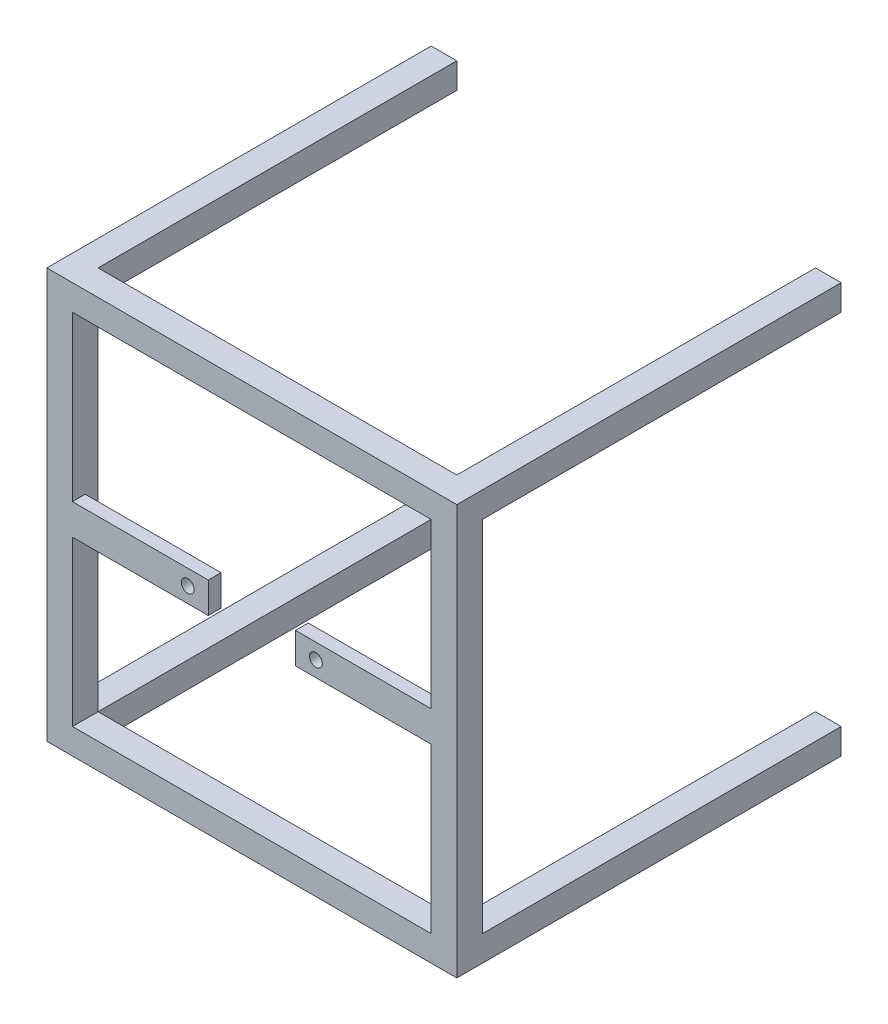
ISO-10303-21;
HEADER;
FILE_DESCRIPTION(('STEP AP214'),'2;1');
FILE_NAME('part.step','',(''),(''),'','','');
FILE_SCHEMA(('AUTOMOTIVE_DESIGN { 1 0 10303 214 1 1 1 1 }'));
ENDSEC;
DATA;
#1=APPLICATION_CONTEXT('core data for automotive mechanical design processes');
#2=APPLICATION_PROTOCOL_DEFINITION('international standard','automotive_design',2000,#1);
#3=PRODUCT_CONTEXT('',#1,'mechanical');
#4=PRODUCT('Part','Part','',(#3));
#5=PRODUCT_RELATED_PRODUCT_CATEGORY('part','',(#4));
#6=PRODUCT_DEFINITION_FORMATION('','',#4);
#7=PRODUCT_DEFINITION_CONTEXT('part definition',#1,'design');
#8=PRODUCT_DEFINITION('design','',#6,#7);
#9=PRODUCT_DEFINITION_SHAPE('','',#8);
#10=(LENGTH_UNIT() NAMED_UNIT(*) SI_UNIT(.MILLI.,.METRE.));
#11=(NAMED_UNIT(*) PLANE_ANGLE_UNIT() SI_UNIT($,.RADIAN.));
#12=(NAMED_UNIT(*) SI_UNIT($,.STERADIAN.) SOLID_ANGLE_UNIT());
#13=UNCERTAINTY_MEASURE_WITH_UNIT(LENGTH_MEASURE(1.E-05),#10,'distance_accuracy_value','');
#14=(GEOMETRIC_REPRESENTATION_CONTEXT(3) GLOBAL_UNCERTAINTY_ASSIGNED_CONTEXT((#13)) GLOBAL_UNIT_ASSIGNED_CONTEXT((#10,
#11,#12)) REPRESENTATION_CONTEXT('',''));
#15=CARTESIAN_POINT('',(0.,0.,0.));
#16=DIRECTION('',(0.,0.,1.));
#17=DIRECTION('',(1.,0.,0.));
#18=AXIS2_PLACEMENT_3D('',#15,#16,#17);
#19=CARTESIAN_POINT('',(0.,0.,10.));
#20=DIRECTION('',(1.,0.,0.));
#21=DIRECTION('',(0.,1.,0.));
#22=AXIS2_PLACEMENT_3D('',#19,#20,#21);
#23=PLANE('',#22);
#24=DIRECTION('',(0.,0.,-1.));
#25=VECTOR('',#24,1.);
#26=CARTESIAN_POINT('',(0.,0.,10.));
#27=LINE('',#26,#25);
#28=CARTESIAN_POINT('',(0.,0.,160.));
#29=VERTEX_POINT('',#28);
#30=CARTESIAN_POINT('',(0.,0.,10.));
#31=VERTEX_POINT('',#30);
#32=EDGE_CURVE('E248',#29,#31,#27,.T.);
#33=ORIENTED_EDGE('',*,*,#32,.T.);
#34=DIRECTION('',(0.,1.,0.));
#35=VECTOR('',#34,1.);
#36=CARTESIAN_POINT('',(0.,0.,10.));
#37=LINE('',#36,#35);
#38=CARTESIAN_POINT('',(0.,-10.,10.));
#39=VERTEX_POINT('',#38);
#40=EDGE_CURVE('E511',#39,#31,#37,.T.);
#41=ORIENTED_EDGE('',*,*,#40,.F.);
#42=DIRECTION('',(0.,0.,1.));
#43=VECTOR('',#42,1.);
#44=CARTESIAN_POINT('',(0.,-10.,0.));
#45=LINE('',#44,#43);
#46=CARTESIAN_POINT('',(0.,-10.,150.));
#47=VERTEX_POINT('',#46);
#48=EDGE_CURVE('E490',#39,#47,#45,.T.);
#49=ORIENTED_EDGE('',*,*,#48,.T.);
#50=DIRECTION('',(0.,-1.,0.));
#51=VECTOR('',#50,1.);
#52=CARTESIAN_POINT('',(0.,0.,150.));
#53=LINE('',#52,#51);
#54=CARTESIAN_POINT('',(0.,-150.,150.));
#55=VERTEX_POINT('',#54);
#56=EDGE_CURVE('E383',#47,#55,#53,.T.);
#57=ORIENTED_EDGE('',*,*,#56,.T.);
#58=DIRECTION('',(0.,0.,1.));
#59=VECTOR('',#58,1.);
#60=CARTESIAN_POINT('',(0.,-150.,0.));
#61=LINE('',#60,#59);
#62=CARTESIAN_POINT('',(0.,-150.,10.));
#63=VERTEX_POINT('',#62);
#64=EDGE_CURVE('E424',#63,#55,#61,.T.);
#65=ORIENTED_EDGE('',*,*,#64,.F.);
#66=CARTESIAN_POINT('',(0.,-160.,10.));
#67=VERTEX_POINT('',#66);
#68=EDGE_CURVE('E927',#67,#63,#37,.T.);
#69=ORIENTED_EDGE('',*,*,#68,.F.);
#70=DIRECTION('',(0.,0.,-1.));
#71=VECTOR('',#70,1.);
#72=CARTESIAN_POINT('',(0.,-160.,10.));
#73=LINE('',#72,#71);
#74=CARTESIAN_POINT('',(0.,-160.,160.));
#75=VERTEX_POINT('',#74);
#76=EDGE_CURVE('E240',#75,#67,#73,.T.);
#77=ORIENTED_EDGE('',*,*,#76,.F.);
#78=DIRECTION('',(0.,-1.,0.));
#79=VECTOR('',#78,1.);
#80=CARTESIAN_POINT('',(0.,0.,160.));
#81=LINE('',#80,#79);
#82=EDGE_CURVE('E384',#29,#75,#81,.T.);
#83=ORIENTED_EDGE('',*,*,#82,.F.);
#84=EDGE_LOOP('',(#33,#41,#49,#57,#65,#69,#77,#83));
#85=FACE_BOUND('',#84,.T.);
#86=ADVANCED_FACE('F39',(#85),#23,.F.);
#87=CARTESIAN_POINT('',(0.,-160.,10.));
#88=DIRECTION('',(0.,1.,0.));
#89=DIRECTION('',(0.,0.,1.));
#90=AXIS2_PLACEMENT_3D('',#87,#88,#89);
#91=PLANE('',#90);
#92=ORIENTED_EDGE('',*,*,#76,.T.);
#93=DIRECTION('',(-1.,0.,0.));
#94=VECTOR('',#93,1.);
#95=CARTESIAN_POINT('',(160.,-160.,10.));
#96=LINE('',#95,#94);
#97=CARTESIAN_POINT('',(10.,-160.,10.));
#98=VERTEX_POINT('',#97);
#99=EDGE_CURVE('E221',#98,#67,#96,.T.);
#100=ORIENTED_EDGE('',*,*,#99,.F.);
#101=DIRECTION('',(0.,0.,1.));
#102=VECTOR('',#101,1.);
#103=CARTESIAN_POINT('',(10.,-160.,0.));
#104=LINE('',#103,#102);
#105=CARTESIAN_POINT('',(10.,-160.,150.));
#106=VERTEX_POINT('',#105);
#107=EDGE_CURVE('E419',#98,#106,#104,.T.);
#108=ORIENTED_EDGE('',*,*,#107,.T.);
#109=DIRECTION('',(1.,0.,0.));
#110=VECTOR('',#109,1.);
#111=CARTESIAN_POINT('',(0.,-160.,150.));
#112=LINE('',#111,#110);
#113=CARTESIAN_POINT('',(150.,-160.,150.));
#114=VERTEX_POINT('',#113);
#115=EDGE_CURVE('E401',#106,#114,#112,.T.);
#116=ORIENTED_EDGE('',*,*,#115,.T.);
#117=DIRECTION('',(0.,0.,1.));
#118=VECTOR('',#117,1.);
#119=CARTESIAN_POINT('',(150.,-160.,0.));
#120=LINE('',#119,#118);
#121=CARTESIAN_POINT('',(150.,-160.,10.));
#122=VERTEX_POINT('',#121);
#123=EDGE_CURVE('E231',#122,#114,#120,.T.);
#124=ORIENTED_EDGE('',*,*,#123,.F.);
#125=CARTESIAN_POINT('',(160.,-160.,10.));
#126=VERTEX_POINT('',#125);
#127=EDGE_CURVE('E213',#126,#122,#96,.T.);
#128=ORIENTED_EDGE('',*,*,#127,.F.);
#129=DIRECTION('',(0.,0.,-1.));
#130=VECTOR('',#129,1.);
#131=CARTESIAN_POINT('',(160.,-160.,10.));
#132=LINE('',#131,#130);
#133=CARTESIAN_POINT('',(160.,-160.,160.));
#134=VERTEX_POINT('',#133);
#135=EDGE_CURVE('E228',#134,#126,#132,.T.);
#136=ORIENTED_EDGE('',*,*,#135,.F.);
#137=DIRECTION('',(1.,0.,0.));
#138=VECTOR('',#137,1.);
#139=CARTESIAN_POINT('',(0.,-160.,160.));
#140=LINE('',#139,#138);
#141=EDGE_CURVE('E387',#75,#134,#140,.T.);
#142=ORIENTED_EDGE('',*,*,#141,.F.);
#143=EDGE_LOOP('',(#92,#100,#108,#116,#124,#128,#136,#142));
#144=FACE_BOUND('',#143,.T.);
#145=ADVANCED_FACE('F226',(#144),#91,.F.);
#146=CARTESIAN_POINT('',(160.,0.,10.));
#147=DIRECTION('',(-1.,0.,0.));
#148=DIRECTION('',(0.,-1.,0.));
#149=AXIS2_PLACEMENT_3D('',#146,#147,#148);
#150=PLANE('',#149);
#151=ORIENTED_EDGE('',*,*,#135,.T.);
#152=DIRECTION('',(0.,1.,0.));
#153=VECTOR('',#152,1.);
#154=CARTESIAN_POINT('',(160.,0.,10.));
#155=LINE('',#154,#153);
#156=CARTESIAN_POINT('',(160.,-150.,10.));
#157=VERTEX_POINT('',#156);
#158=EDGE_CURVE('E209',#126,#157,#155,.T.);
#159=ORIENTED_EDGE('',*,*,#158,.T.);
#160=DIRECTION('',(0.,0.,1.));
#161=VECTOR('',#160,1.);
#162=CARTESIAN_POINT('',(160.,-150.,0.));
#163=LINE('',#162,#161);
#164=CARTESIAN_POINT('',(160.,-150.,150.));
#165=VERTEX_POINT('',#164);
#166=EDGE_CURVE('E446',#157,#165,#163,.T.);
#167=ORIENTED_EDGE('',*,*,#166,.T.);
#168=DIRECTION('',(0.,1.,0.));
#169=VECTOR('',#168,1.);
#170=CARTESIAN_POINT('',(160.,0.,150.));
#171=LINE('',#170,#169);
#172=CARTESIAN_POINT('',(160.,-10.,150.));
#173=VERTEX_POINT('',#172);
#174=EDGE_CURVE('E404',#165,#173,#171,.T.);
#175=ORIENTED_EDGE('',*,*,#174,.T.);
#176=DIRECTION('',(0.,0.,1.));
#177=VECTOR('',#176,1.);
#178=CARTESIAN_POINT('',(160.,-10.,0.));
#179=LINE('',#178,#177);
#180=CARTESIAN_POINT('',(160.,-10.,10.));
#181=VERTEX_POINT('',#180);
#182=EDGE_CURVE('E465',#181,#173,#179,.T.);
#183=ORIENTED_EDGE('',*,*,#182,.F.);
#184=CARTESIAN_POINT('',(160.,0.,10.));
#185=VERTEX_POINT('',#184);
#186=EDGE_CURVE('E222',#181,#185,#155,.T.);
#187=ORIENTED_EDGE('',*,*,#186,.T.);
#188=DIRECTION('',(0.,0.,-1.));
#189=VECTOR('',#188,1.);
#190=CARTESIAN_POINT('',(160.,0.,10.));
#191=LINE('',#190,#189);
#192=CARTESIAN_POINT('',(160.,0.,160.));
#193=VERTEX_POINT('',#192);
#194=EDGE_CURVE('E241',#193,#185,#191,.T.);
#195=ORIENTED_EDGE('',*,*,#194,.F.);
#196=DIRECTION('',(0.,1.,0.));
#197=VECTOR('',#196,1.);
#198=CARTESIAN_POINT('',(160.,0.,160.));
#199=LINE('',#198,#197);
#200=EDGE_CURVE('E238',#134,#193,#199,.T.);
#201=ORIENTED_EDGE('',*,*,#200,.F.);
#202=EDGE_LOOP('',(#151,#159,#167,#175,#183,#187,#195,#201));
#203=FACE_BOUND('',#202,.T.);
#204=ADVANCED_FACE('F236',(#203),#150,.F.);
#205=CARTESIAN_POINT('',(0.,0.,10.));
#206=DIRECTION('',(0.,-1.,0.));
#207=DIRECTION('',(0.,0.,-1.));
#208=AXIS2_PLACEMENT_3D('',#205,#206,#207);
#209=PLANE('',#208);
#210=ORIENTED_EDGE('',*,*,#194,.T.);
#211=DIRECTION('',(-1.,0.,0.));
#212=VECTOR('',#211,1.);
#213=CARTESIAN_POINT('',(160.,0.,10.));
#214=LINE('',#213,#212);
#215=CARTESIAN_POINT('',(150.,0.,10.));
#216=VERTEX_POINT('',#215);
#217=EDGE_CURVE('E523',#185,#216,#214,.T.);
#218=ORIENTED_EDGE('',*,*,#217,.T.);
#219=DIRECTION('',(0.,0.,1.));
#220=VECTOR('',#219,1.);
#221=CARTESIAN_POINT('',(150.,0.,0.));
#222=LINE('',#221,#220);
#223=CARTESIAN_POINT('',(150.,0.,150.));
#224=VERTEX_POINT('',#223);
#225=EDGE_CURVE('E464',#216,#224,#222,.T.);
#226=ORIENTED_EDGE('',*,*,#225,.T.);
#227=DIRECTION('',(-1.,0.,0.));
#228=VECTOR('',#227,1.);
#229=CARTESIAN_POINT('',(0.,0.,150.));
#230=LINE('',#229,#228);
#231=CARTESIAN_POINT('',(10.,0.,150.));
#232=VERTEX_POINT('',#231);
#233=EDGE_CURVE('E388',#224,#232,#230,.T.);
#234=ORIENTED_EDGE('',*,*,#233,.T.);
#235=DIRECTION('',(0.,0.,1.));
#236=VECTOR('',#235,1.);
#237=CARTESIAN_POINT('',(10.,0.,0.));
#238=LINE('',#237,#236);
#239=CARTESIAN_POINT('',(10.,0.,10.));
#240=VERTEX_POINT('',#239);
#241=EDGE_CURVE('E491',#240,#232,#238,.T.);
#242=ORIENTED_EDGE('',*,*,#241,.F.);
#243=EDGE_CURVE('E233',#240,#31,#214,.T.);
#244=ORIENTED_EDGE('',*,*,#243,.T.);
#245=ORIENTED_EDGE('',*,*,#32,.F.);
#246=DIRECTION('',(-1.,0.,0.));
#247=VECTOR('',#246,1.);
#248=CARTESIAN_POINT('',(0.,0.,160.));
#249=LINE('',#248,#247);
#250=EDGE_CURVE('E393',#193,#29,#249,.T.);
#251=ORIENTED_EDGE('',*,*,#250,.F.);
#252=EDGE_LOOP('',(#210,#218,#226,#234,#242,#244,#245,#251));
#253=FACE_BOUND('',#252,.T.);
#254=ADVANCED_FACE('F517',(#253),#209,.F.);
#255=CARTESIAN_POINT('',(10.,0.,0.));
#256=DIRECTION('',(1.,0.,0.));
#257=DIRECTION('',(0.,0.,-1.));
#258=AXIS2_PLACEMENT_3D('',#255,#256,#257);
#259=PLANE('',#258);
#260=DIRECTION('',(0.,0.,1.));
#261=VECTOR('',#260,1.);
#262=CARTESIAN_POINT('',(10.,-10.,0.));
#263=LINE('',#262,#261);
#264=CARTESIAN_POINT('',(10.,-10.,10.));
#265=VERTEX_POINT('',#264);
#266=CARTESIAN_POINT('',(10.,-10.,150.));
#267=VERTEX_POINT('',#266);
#268=EDGE_CURVE('E495',#265,#267,#263,.T.);
#269=ORIENTED_EDGE('',*,*,#268,.F.);
#270=DIRECTION('',(0.,1.,0.));
#271=VECTOR('',#270,1.);
#272=CARTESIAN_POINT('',(10.,0.,10.));
#273=LINE('',#272,#271);
#274=EDGE_CURVE('E503',#265,#240,#273,.T.);
#275=ORIENTED_EDGE('',*,*,#274,.T.);
#276=ORIENTED_EDGE('',*,*,#241,.T.);
#277=DIRECTION('',(0.,1.,0.));
#278=VECTOR('',#277,1.);
#279=CARTESIAN_POINT('',(10.,0.,150.));
#280=LINE('',#279,#278);
#281=EDGE_CURVE('E486',#267,#232,#280,.T.);
#282=ORIENTED_EDGE('',*,*,#281,.F.);
#283=EDGE_LOOP('',(#269,#275,#276,#282));
#284=FACE_BOUND('',#283,.T.);
#285=ADVANCED_FACE('F597',(#284),#259,.T.);
#286=CARTESIAN_POINT('',(0.,-10.,0.));
#287=DIRECTION('',(0.,-1.,0.));
#288=DIRECTION('',(0.,0.,-1.));
#289=AXIS2_PLACEMENT_3D('',#286,#287,#288);
#290=PLANE('',#289);
#291=DIRECTION('',(1.,0.,0.));
#292=VECTOR('',#291,1.);
#293=CARTESIAN_POINT('',(0.,-10.,10.));
#294=LINE('',#293,#292);
#295=EDGE_CURVE('E494',#39,#265,#294,.T.);
#296=ORIENTED_EDGE('',*,*,#295,.T.);
#297=ORIENTED_EDGE('',*,*,#268,.T.);
#298=DIRECTION('',(1.,0.,0.));
#299=VECTOR('',#298,1.);
#300=CARTESIAN_POINT('',(0.,-10.,150.));
#301=LINE('',#300,#299);
#302=EDGE_CURVE('E482',#47,#267,#301,.T.);
#303=ORIENTED_EDGE('',*,*,#302,.F.);
#304=ORIENTED_EDGE('',*,*,#48,.F.);
#305=EDGE_LOOP('',(#296,#297,#303,#304));
#306=FACE_BOUND('',#305,.T.);
#307=ADVANCED_FACE('F598',(#306),#290,.T.);
#308=CARTESIAN_POINT('',(160.,-10.,0.));
#309=DIRECTION('',(0.,-1.,0.));
#310=DIRECTION('',(1.,0.,0.));
#311=AXIS2_PLACEMENT_3D('',#308,#309,#310);
#312=PLANE('',#311);
#313=DIRECTION('',(0.,0.,1.));
#314=VECTOR('',#313,1.);
#315=CARTESIAN_POINT('',(150.,-10.,0.));
#316=LINE('',#315,#314);
#317=CARTESIAN_POINT('',(150.,-10.,10.));
#318=VERTEX_POINT('',#317);
#319=CARTESIAN_POINT('',(150.,-10.,150.));
#320=VERTEX_POINT('',#319);
#321=EDGE_CURVE('E469',#318,#320,#316,.T.);
#322=ORIENTED_EDGE('',*,*,#321,.F.);
#323=DIRECTION('',(1.,0.,0.));
#324=VECTOR('',#323,1.);
#325=CARTESIAN_POINT('',(0.,-10.,10.));
#326=LINE('',#325,#324);
#327=EDGE_CURVE('E478',#318,#181,#326,.T.);
#328=ORIENTED_EDGE('',*,*,#327,.T.);
#329=ORIENTED_EDGE('',*,*,#182,.T.);
#330=DIRECTION('',(1.,0.,0.));
#331=VECTOR('',#330,1.);
#332=CARTESIAN_POINT('',(160.,-10.,150.));
#333=LINE('',#332,#331);
#334=EDGE_CURVE('E460',#320,#173,#333,.T.);
#335=ORIENTED_EDGE('',*,*,#334,.F.);
#336=EDGE_LOOP('',(#322,#328,#329,#335));
#337=FACE_BOUND('',#336,.T.);
#338=ADVANCED_FACE('F601',(#337),#312,.T.);
#339=CARTESIAN_POINT('',(150.,0.,0.));
#340=DIRECTION('',(-1.,0.,0.));
#341=DIRECTION('',(0.,0.,1.));
#342=AXIS2_PLACEMENT_3D('',#339,#340,#341);
#343=PLANE('',#342);
#344=DIRECTION('',(0.,-1.,0.));
#345=VECTOR('',#344,1.);
#346=CARTESIAN_POINT('',(150.,0.,10.));
#347=LINE('',#346,#345);
#348=EDGE_CURVE('E468',#216,#318,#347,.T.);
#349=ORIENTED_EDGE('',*,*,#348,.T.);
#350=ORIENTED_EDGE('',*,*,#321,.T.);
#351=DIRECTION('',(0.,-1.,0.));
#352=VECTOR('',#351,1.);
#353=CARTESIAN_POINT('',(150.,0.,150.));
#354=LINE('',#353,#352);
#355=EDGE_CURVE('E456',#224,#320,#354,.T.);
#356=ORIENTED_EDGE('',*,*,#355,.F.);
#357=ORIENTED_EDGE('',*,*,#225,.F.);
#358=EDGE_LOOP('',(#349,#350,#356,#357));
#359=FACE_BOUND('',#358,.T.);
#360=ADVANCED_FACE('F531',(#359),#343,.T.);
#361=CARTESIAN_POINT('',(150.,-150.,0.));
#362=DIRECTION('',(-1.,0.,0.));
#363=DIRECTION('',(0.,0.,1.));
#364=AXIS2_PLACEMENT_3D('',#361,#362,#363);
#365=PLANE('',#364);
#366=DIRECTION('',(0.,-1.,0.));
#367=VECTOR('',#366,1.);
#368=CARTESIAN_POINT('',(150.,0.,10.));
#369=LINE('',#368,#367);
#370=CARTESIAN_POINT('',(150.,-150.,10.));
#371=VERTEX_POINT('',#370);
#372=EDGE_CURVE('E453',#371,#122,#369,.T.);
#373=ORIENTED_EDGE('',*,*,#372,.T.);
#374=ORIENTED_EDGE('',*,*,#123,.T.);
#375=DIRECTION('',(0.,-1.,0.));
#376=VECTOR('',#375,1.);
#377=CARTESIAN_POINT('',(150.,-150.,150.));
#378=LINE('',#377,#376);
#379=CARTESIAN_POINT('',(150.,-150.,150.));
#380=VERTEX_POINT('',#379);
#381=EDGE_CURVE('E435',#380,#114,#378,.T.);
#382=ORIENTED_EDGE('',*,*,#381,.F.);
#383=DIRECTION('',(0.,0.,1.));
#384=VECTOR('',#383,1.);
#385=CARTESIAN_POINT('',(150.,-150.,0.));
#386=LINE('',#385,#384);
#387=EDGE_CURVE('E443',#371,#380,#386,.T.);
#388=ORIENTED_EDGE('',*,*,#387,.F.);
#389=EDGE_LOOP('',(#373,#374,#382,#388));
#390=FACE_BOUND('',#389,.T.);
#391=ADVANCED_FACE('F608',(#390),#365,.T.);
#392=CARTESIAN_POINT('',(150.,-150.,0.));
#393=DIRECTION('',(0.,1.,0.));
#394=DIRECTION('',(0.,0.,1.));
#395=AXIS2_PLACEMENT_3D('',#392,#393,#394);
#396=PLANE('',#395);
#397=DIRECTION('',(-1.,0.,0.));
#398=VECTOR('',#397,1.);
#399=CARTESIAN_POINT('',(0.,-150.,10.));
#400=LINE('',#399,#398);
#401=EDGE_CURVE('E215',#157,#371,#400,.T.);
#402=ORIENTED_EDGE('',*,*,#401,.T.);
#403=ORIENTED_EDGE('',*,*,#387,.T.);
#404=DIRECTION('',(-1.,0.,0.));
#405=VECTOR('',#404,1.);
#406=CARTESIAN_POINT('',(150.,-150.,150.));
#407=LINE('',#406,#405);
#408=EDGE_CURVE('E439',#165,#380,#407,.T.);
#409=ORIENTED_EDGE('',*,*,#408,.F.);
#410=ORIENTED_EDGE('',*,*,#166,.F.);
#411=EDGE_LOOP('',(#402,#403,#409,#410));
#412=FACE_BOUND('',#411,.T.);
#413=ADVANCED_FACE('F614',(#412),#396,.T.);
#414=CARTESIAN_POINT('',(10.,-150.,0.));
#415=DIRECTION('',(1.,0.,0.));
#416=DIRECTION('',(0.,1.,0.));
#417=AXIS2_PLACEMENT_3D('',#414,#415,#416);
#418=PLANE('',#417);
#419=ORIENTED_EDGE('',*,*,#107,.F.);
#420=DIRECTION('',(0.,1.,0.));
#421=VECTOR('',#420,1.);
#422=CARTESIAN_POINT('',(9.99999999999999,0.,10.));
#423=LINE('',#422,#421);
#424=CARTESIAN_POINT('',(10.,-150.,10.));
#425=VERTEX_POINT('',#424);
#426=EDGE_CURVE('E431',#98,#425,#423,.T.);
#427=ORIENTED_EDGE('',*,*,#426,.T.);
#428=DIRECTION('',(0.,0.,1.));
#429=VECTOR('',#428,1.);
#430=CARTESIAN_POINT('',(10.,-150.,0.));
#431=LINE('',#430,#429);
#432=CARTESIAN_POINT('',(10.,-150.,150.));
#433=VERTEX_POINT('',#432);
#434=EDGE_CURVE('E418',#425,#433,#431,.T.);
#435=ORIENTED_EDGE('',*,*,#434,.T.);
#436=DIRECTION('',(0.,1.,0.));
#437=VECTOR('',#436,1.);
#438=CARTESIAN_POINT('',(10.,-150.,150.));
#439=LINE('',#438,#437);
#440=EDGE_CURVE('E397',#106,#433,#439,.T.);
#441=ORIENTED_EDGE('',*,*,#440,.F.);
#442=EDGE_LOOP('',(#419,#427,#435,#441));
#443=FACE_BOUND('',#442,.T.);
#444=ADVANCED_FACE('F618',(#443),#418,.T.);
#445=CARTESIAN_POINT('',(10.,-150.,0.));
#446=DIRECTION('',(0.,1.,0.));
#447=DIRECTION('',(0.,0.,1.));
#448=AXIS2_PLACEMENT_3D('',#445,#446,#447);
#449=PLANE('',#448);
#450=DIRECTION('',(-1.,0.,0.));
#451=VECTOR('',#450,1.);
#452=CARTESIAN_POINT('',(0.,-150.,10.));
#453=LINE('',#452,#451);
#454=EDGE_CURVE('E423',#425,#63,#453,.T.);
#455=ORIENTED_EDGE('',*,*,#454,.T.);
#456=ORIENTED_EDGE('',*,*,#64,.T.);
#457=DIRECTION('',(-1.,0.,0.));
#458=VECTOR('',#457,1.);
#459=CARTESIAN_POINT('',(10.,-150.,150.));
#460=LINE('',#459,#458);
#461=EDGE_CURVE('E414',#433,#55,#460,.T.);
#462=ORIENTED_EDGE('',*,*,#461,.F.);
#463=ORIENTED_EDGE('',*,*,#434,.F.);
#464=EDGE_LOOP('',(#455,#456,#462,#463));
#465=FACE_BOUND('',#464,.T.);
#466=ADVANCED_FACE('F621',(#465),#449,.T.);
#467=CARTESIAN_POINT('',(0.,0.,150.));
#468=DIRECTION('',(0.,0.,1.));
#469=DIRECTION('',(1.,0.,0.));
#470=AXIS2_PLACEMENT_3D('',#467,#468,#469);
#471=PLANE('',#470);
#472=ORIENTED_EDGE('',*,*,#281,.T.);
#473=ORIENTED_EDGE('',*,*,#233,.F.);
#474=ORIENTED_EDGE('',*,*,#355,.T.);
#475=DIRECTION('',(-1.,0.,0.));
#476=VECTOR('',#475,1.);
#477=CARTESIAN_POINT('',(10.,-10.,150.));
#478=LINE('',#477,#476);
#479=EDGE_CURVE('E364',#320,#267,#478,.T.);
#480=ORIENTED_EDGE('',*,*,#479,.T.);
#481=EDGE_LOOP('',(#472,#473,#474,#480));
#482=FACE_BOUND('',#481,.T.);
#483=ADVANCED_FACE('F535',(#482),#471,.F.);
#484=ORIENTED_EDGE('',*,*,#334,.T.);
#485=ORIENTED_EDGE('',*,*,#174,.F.);
#486=ORIENTED_EDGE('',*,*,#408,.T.);
#487=DIRECTION('',(0.,1.,0.));
#488=VECTOR('',#487,1.);
#489=CARTESIAN_POINT('',(150.,-10.,150.));
#490=LINE('',#489,#488);
#491=EDGE_CURVE('E360',#380,#320,#490,.T.);
#492=ORIENTED_EDGE('',*,*,#491,.T.);
#493=EDGE_LOOP('',(#484,#485,#486,#492));
#494=FACE_BOUND('',#493,.T.);
#495=ADVANCED_FACE('F546',(#494),#471,.F.);
#496=ORIENTED_EDGE('',*,*,#381,.T.);
#497=ORIENTED_EDGE('',*,*,#115,.F.);
#498=ORIENTED_EDGE('',*,*,#440,.T.);
#499=DIRECTION('',(1.,0.,0.));
#500=VECTOR('',#499,1.);
#501=CARTESIAN_POINT('',(10.,-150.,150.));
#502=LINE('',#501,#500);
#503=EDGE_CURVE('E356',#433,#380,#502,.T.);
#504=ORIENTED_EDGE('',*,*,#503,.T.);
#505=EDGE_LOOP('',(#496,#497,#498,#504));
#506=FACE_BOUND('',#505,.T.);
#507=ADVANCED_FACE('F630',(#506),#471,.F.);
#508=CARTESIAN_POINT('',(0.,0.,160.));
#509=DIRECTION('',(0.,0.,1.));
#510=DIRECTION('',(1.,0.,0.));
#511=AXIS2_PLACEMENT_3D('',#508,#509,#510);
#512=PLANE('',#511);
#513=DIRECTION('',(0.,1.,0.));
#514=VECTOR('',#513,1.);
#515=CARTESIAN_POINT('',(150.,-10.,160.));
#516=LINE('',#515,#514);
#517=CARTESIAN_POINT('',(150.,-74.,160.));
#518=VERTEX_POINT('',#517);
#519=CARTESIAN_POINT('',(150.,-10.,160.));
#520=VERTEX_POINT('',#519);
#521=EDGE_CURVE('E346',#518,#520,#516,.T.);
#522=ORIENTED_EDGE('',*,*,#521,.F.);
#523=DIRECTION('',(-1.,0.,0.));
#524=VECTOR('',#523,1.);
#525=CARTESIAN_POINT('',(97.,-74.,160.));
#526=LINE('',#525,#524);
#527=CARTESIAN_POINT('',(97.,-74.,160.));
#528=VERTEX_POINT('',#527);
#529=EDGE_CURVE('E283',#518,#528,#526,.T.);
#530=ORIENTED_EDGE('',*,*,#529,.T.);
#531=DIRECTION('',(0.,-1.,0.));
#532=VECTOR('',#531,1.);
#533=CARTESIAN_POINT('',(97.,-74.,160.));
#534=LINE('',#533,#532);
#535=CARTESIAN_POINT('',(97.,-86.,160.));
#536=VERTEX_POINT('',#535);
#537=EDGE_CURVE('E281',#528,#536,#534,.T.);
#538=ORIENTED_EDGE('',*,*,#537,.T.);
#539=DIRECTION('',(1.,0.,0.));
#540=VECTOR('',#539,1.);
#541=CARTESIAN_POINT('',(97.,-86.,160.));
#542=LINE('',#541,#540);
#543=CARTESIAN_POINT('',(150.,-86.,160.));
#544=VERTEX_POINT('',#543);
#545=EDGE_CURVE('E270',#536,#544,#542,.T.);
#546=ORIENTED_EDGE('',*,*,#545,.T.);
#547=CARTESIAN_POINT('',(150.,-150.,160.));
#548=VERTEX_POINT('',#547);
#549=EDGE_CURVE('E279',#548,#544,#516,.T.);
#550=ORIENTED_EDGE('',*,*,#549,.F.);
#551=DIRECTION('',(1.,0.,0.));
#552=VECTOR('',#551,1.);
#553=CARTESIAN_POINT('',(10.,-150.,160.));
#554=LINE('',#553,#552);
#555=CARTESIAN_POINT('',(10.,-150.,160.));
#556=VERTEX_POINT('',#555);
#557=EDGE_CURVE('E342',#556,#548,#554,.T.);
#558=ORIENTED_EDGE('',*,*,#557,.F.);
#559=DIRECTION('',(0.,-1.,0.));
#560=VECTOR('',#559,1.);
#561=CARTESIAN_POINT('',(10.,-10.,160.));
#562=LINE('',#561,#560);
#563=CARTESIAN_POINT('',(10.,-86.,160.));
#564=VERTEX_POINT('',#563);
#565=EDGE_CURVE('E343',#564,#556,#562,.T.);
#566=ORIENTED_EDGE('',*,*,#565,.F.);
#567=DIRECTION('',(1.,0.,0.));
#568=VECTOR('',#567,1.);
#569=CARTESIAN_POINT('',(63.,-86.,160.));
#570=LINE('',#569,#568);
#571=CARTESIAN_POINT('',(63.,-86.,160.));
#572=VERTEX_POINT('',#571);
#573=EDGE_CURVE('E315',#564,#572,#570,.T.);
#574=ORIENTED_EDGE('',*,*,#573,.T.);
#575=DIRECTION('',(0.,1.,0.));
#576=VECTOR('',#575,1.);
#577=CARTESIAN_POINT('',(63.,-74.,160.));
#578=LINE('',#577,#576);
#579=CARTESIAN_POINT('',(63.,-74.,160.));
#580=VERTEX_POINT('',#579);
#581=EDGE_CURVE('E306',#572,#580,#578,.T.);
#582=ORIENTED_EDGE('',*,*,#581,.T.);
#583=DIRECTION('',(-1.,0.,0.));
#584=VECTOR('',#583,1.);
#585=CARTESIAN_POINT('',(63.,-74.,160.));
#586=LINE('',#585,#584);
#587=CARTESIAN_POINT('',(10.,-74.,160.));
#588=VERTEX_POINT('',#587);
#589=EDGE_CURVE('E326',#580,#588,#586,.T.);
#590=ORIENTED_EDGE('',*,*,#589,.T.);
#591=CARTESIAN_POINT('',(10.,-10.,160.));
#592=VERTEX_POINT('',#591);
#593=EDGE_CURVE('E339',#592,#588,#562,.T.);
#594=ORIENTED_EDGE('',*,*,#593,.F.);
#595=DIRECTION('',(-1.,0.,0.));
#596=VECTOR('',#595,1.);
#597=CARTESIAN_POINT('',(10.,-10.,160.));
#598=LINE('',#597,#596);
#599=EDGE_CURVE('E349',#520,#592,#598,.T.);
#600=ORIENTED_EDGE('',*,*,#599,.F.);
#601=EDGE_LOOP('',(#522,#530,#538,#546,#550,#558,#566,#574,#582,#590,#594,#600));
#602=FACE_BOUND('',#601,.T.);
#603=ORIENTED_EDGE('',*,*,#200,.T.);
#604=ORIENTED_EDGE('',*,*,#250,.T.);
#605=ORIENTED_EDGE('',*,*,#82,.T.);
#606=ORIENTED_EDGE('',*,*,#141,.T.);
#607=EDGE_LOOP('',(#603,#604,#605,#606));
#608=FACE_BOUND('',#607,.T.);
#609=CARTESIAN_POINT('',(55.,-80.,160.));
#610=DIRECTION('',(0.,0.,1.));
#611=DIRECTION('',(1.,0.,0.));
#612=AXIS2_PLACEMENT_3D('',#609,#610,#611);
#613=CIRCLE('',#612,2.5);
#614=CARTESIAN_POINT('',(57.5,-80.,160.));
#615=VERTEX_POINT('',#614);
#616=EDGE_CURVE('E297',#615,#615,#613,.T.);
#617=ORIENTED_EDGE('',*,*,#616,.F.);
#618=EDGE_LOOP('',(#617));
#619=FACE_BOUND('',#618,.T.);
#620=CARTESIAN_POINT('',(105.,-80.,160.));
#621=DIRECTION('',(0.,0.,1.));
#622=DIRECTION('',(-1.,0.,0.));
#623=AXIS2_PLACEMENT_3D('',#620,#621,#622);
#624=CIRCLE('',#623,2.5);
#625=CARTESIAN_POINT('',(102.5,-80.,160.));
#626=VERTEX_POINT('',#625);
#627=EDGE_CURVE('E528',#626,#626,#624,.T.);
#628=ORIENTED_EDGE('',*,*,#627,.F.);
#629=EDGE_LOOP('',(#628));
#630=FACE_BOUND('',#629,.T.);
#631=ADVANCED_FACE('F276',(#602,#608,#619,#630),#512,.T.);
#632=ORIENTED_EDGE('',*,*,#302,.T.);
#633=DIRECTION('',(0.,-1.,0.));
#634=VECTOR('',#633,1.);
#635=CARTESIAN_POINT('',(10.,-10.,150.));
#636=LINE('',#635,#634);
#637=EDGE_CURVE('E336',#267,#433,#636,.T.);
#638=ORIENTED_EDGE('',*,*,#637,.T.);
#639=ORIENTED_EDGE('',*,*,#461,.T.);
#640=ORIENTED_EDGE('',*,*,#56,.F.);
#641=EDGE_LOOP('',(#632,#638,#639,#640));
#642=FACE_BOUND('',#641,.T.);
#643=ADVANCED_FACE('F626',(#642),#471,.F.);
#644=CARTESIAN_POINT('',(10.,-10.,160.));
#645=DIRECTION('',(1.,0.,0.));
#646=DIRECTION('',(0.,1.,0.));
#647=AXIS2_PLACEMENT_3D('',#644,#645,#646);
#648=PLANE('',#647);
#649=DIRECTION('',(0.,0.,-1.));
#650=VECTOR('',#649,1.);
#651=CARTESIAN_POINT('',(10.,-86.,160.));
#652=LINE('',#651,#650);
#653=CARTESIAN_POINT('',(10.,-86.,155.));
#654=VERTEX_POINT('',#653);
#655=EDGE_CURVE('E259',#564,#654,#652,.T.);
#656=ORIENTED_EDGE('',*,*,#655,.F.);
#657=ORIENTED_EDGE('',*,*,#565,.T.);
#658=DIRECTION('',(0.,0.,-1.));
#659=VECTOR('',#658,1.);
#660=CARTESIAN_POINT('',(10.,-150.,160.));
#661=LINE('',#660,#659);
#662=EDGE_CURVE('E379',#556,#433,#661,.T.);
#663=ORIENTED_EDGE('',*,*,#662,.T.);
#664=ORIENTED_EDGE('',*,*,#637,.F.);
#665=DIRECTION('',(0.,0.,-1.));
#666=VECTOR('',#665,1.);
#667=CARTESIAN_POINT('',(10.,-10.,160.));
#668=LINE('',#667,#666);
#669=EDGE_CURVE('E352',#592,#267,#668,.T.);
#670=ORIENTED_EDGE('',*,*,#669,.F.);
#671=ORIENTED_EDGE('',*,*,#593,.T.);
#672=DIRECTION('',(0.,0.,1.));
#673=VECTOR('',#672,1.);
#674=CARTESIAN_POINT('',(10.,-74.,160.));
#675=LINE('',#674,#673);
#676=CARTESIAN_POINT('',(10.,-74.,155.));
#677=VERTEX_POINT('',#676);
#678=EDGE_CURVE('E255',#677,#588,#675,.T.);
#679=ORIENTED_EDGE('',*,*,#678,.F.);
#680=DIRECTION('',(0.,1.,0.));
#681=VECTOR('',#680,1.);
#682=CARTESIAN_POINT('',(10.,-10.,155.));
#683=LINE('',#682,#681);
#684=EDGE_CURVE('E245',#654,#677,#683,.T.);
#685=ORIENTED_EDGE('',*,*,#684,.F.);
#686=EDGE_LOOP('',(#656,#657,#663,#664,#670,#671,#679,#685));
#687=FACE_BOUND('',#686,.T.);
#688=ADVANCED_FACE('F557',(#687),#648,.T.);
#689=CARTESIAN_POINT('',(10.,-150.,160.));
#690=DIRECTION('',(0.,1.,0.));
#691=DIRECTION('',(0.,0.,1.));
#692=AXIS2_PLACEMENT_3D('',#689,#690,#691);
#693=PLANE('',#692);
#694=ORIENTED_EDGE('',*,*,#503,.F.);
#695=ORIENTED_EDGE('',*,*,#662,.F.);
#696=ORIENTED_EDGE('',*,*,#557,.T.);
#697=DIRECTION('',(0.,0.,-1.));
#698=VECTOR('',#697,1.);
#699=CARTESIAN_POINT('',(150.,-150.,160.));
#700=LINE('',#699,#698);
#701=EDGE_CURVE('E375',#548,#380,#700,.T.);
#702=ORIENTED_EDGE('',*,*,#701,.T.);
#703=EDGE_LOOP('',(#694,#695,#696,#702));
#704=FACE_BOUND('',#703,.T.);
#705=ADVANCED_FACE('F551',(#704),#693,.T.);
#706=CARTESIAN_POINT('',(150.,-10.,160.));
#707=DIRECTION('',(-1.,0.,0.));
#708=DIRECTION('',(0.,-1.,0.));
#709=AXIS2_PLACEMENT_3D('',#706,#707,#708);
#710=PLANE('',#709);
#711=DIRECTION('',(0.,0.,-1.));
#712=VECTOR('',#711,1.);
#713=CARTESIAN_POINT('',(150.,-74.,160.));
#714=LINE('',#713,#712);
#715=CARTESIAN_POINT('',(150.,-74.,155.));
#716=VERTEX_POINT('',#715);
#717=EDGE_CURVE('E11',#518,#716,#714,.T.);
#718=ORIENTED_EDGE('',*,*,#717,.F.);
#719=ORIENTED_EDGE('',*,*,#521,.T.);
#720=DIRECTION('',(0.,0.,-1.));
#721=VECTOR('',#720,1.);
#722=CARTESIAN_POINT('',(150.,-10.,160.));
#723=LINE('',#722,#721);
#724=EDGE_CURVE('E371',#520,#320,#723,.T.);
#725=ORIENTED_EDGE('',*,*,#724,.T.);
#726=ORIENTED_EDGE('',*,*,#491,.F.);
#727=ORIENTED_EDGE('',*,*,#701,.F.);
#728=ORIENTED_EDGE('',*,*,#549,.T.);
#729=DIRECTION('',(0.,0.,1.));
#730=VECTOR('',#729,1.);
#731=CARTESIAN_POINT('',(150.,-86.,160.));
#732=LINE('',#731,#730);
#733=CARTESIAN_POINT('',(150.,-86.,155.));
#734=VERTEX_POINT('',#733);
#735=EDGE_CURVE('E47',#734,#544,#732,.T.);
#736=ORIENTED_EDGE('',*,*,#735,.F.);
#737=DIRECTION('',(0.,1.,0.));
#738=VECTOR('',#737,1.);
#739=CARTESIAN_POINT('',(150.,-10.,155.));
#740=LINE('',#739,#738);
#741=EDGE_CURVE('E54',#734,#716,#740,.T.);
#742=ORIENTED_EDGE('',*,*,#741,.T.);
#743=EDGE_LOOP('',(#718,#719,#725,#726,#727,#728,#736,#742));
#744=FACE_BOUND('',#743,.T.);
#745=ADVANCED_FACE('F539',(#744),#710,.T.);
#746=CARTESIAN_POINT('',(10.,-10.,160.));
#747=DIRECTION('',(0.,-1.,0.));
#748=DIRECTION('',(0.,0.,-1.));
#749=AXIS2_PLACEMENT_3D('',#746,#747,#748);
#750=PLANE('',#749);
#751=ORIENTED_EDGE('',*,*,#479,.F.);
#752=ORIENTED_EDGE('',*,*,#724,.F.);
#753=ORIENTED_EDGE('',*,*,#599,.T.);
#754=ORIENTED_EDGE('',*,*,#669,.T.);
#755=EDGE_LOOP('',(#751,#752,#753,#754));
#756=FACE_BOUND('',#755,.T.);
#757=ADVANCED_FACE('F543',(#756),#750,.T.);
#758=CARTESIAN_POINT('',(63.,-74.,155.));
#759=DIRECTION('',(1.,0.,0.));
#760=DIRECTION('',(0.,0.,-1.));
#761=AXIS2_PLACEMENT_3D('',#758,#759,#760);
#762=PLANE('',#761);
#763=ORIENTED_EDGE('',*,*,#581,.F.);
#764=DIRECTION('',(0.,0.,1.));
#765=VECTOR('',#764,1.);
#766=CARTESIAN_POINT('',(63.,-86.,155.));
#767=LINE('',#766,#765);
#768=CARTESIAN_POINT('',(63.,-86.,155.));
#769=VERTEX_POINT('',#768);
#770=EDGE_CURVE('E332',#769,#572,#767,.T.);
#771=ORIENTED_EDGE('',*,*,#770,.F.);
#772=DIRECTION('',(0.,1.,0.));
#773=VECTOR('',#772,1.);
#774=CARTESIAN_POINT('',(63.,-74.,155.));
#775=LINE('',#774,#773);
#776=CARTESIAN_POINT('',(63.,-74.,155.));
#777=VERTEX_POINT('',#776);
#778=EDGE_CURVE('E310',#769,#777,#775,.T.);
#779=ORIENTED_EDGE('',*,*,#778,.T.);
#780=DIRECTION('',(0.,0.,1.));
#781=VECTOR('',#780,1.);
#782=CARTESIAN_POINT('',(63.,-74.,155.));
#783=LINE('',#782,#781);
#784=EDGE_CURVE('E322',#777,#580,#783,.T.);
#785=ORIENTED_EDGE('',*,*,#784,.T.);
#786=EDGE_LOOP('',(#763,#771,#779,#785));
#787=FACE_BOUND('',#786,.T.);
#788=ADVANCED_FACE('F565',(#787),#762,.T.);
#789=CARTESIAN_POINT('',(63.,-86.,155.));
#790=DIRECTION('',(0.,-1.,0.));
#791=DIRECTION('',(1.,0.,0.));
#792=AXIS2_PLACEMENT_3D('',#789,#790,#791);
#793=PLANE('',#792);
#794=ORIENTED_EDGE('',*,*,#573,.F.);
#795=ORIENTED_EDGE('',*,*,#655,.T.);
#796=DIRECTION('',(1.,0.,0.));
#797=VECTOR('',#796,1.);
#798=CARTESIAN_POINT('',(63.,-86.,155.));
#799=LINE('',#798,#797);
#800=EDGE_CURVE('E319',#654,#769,#799,.T.);
#801=ORIENTED_EDGE('',*,*,#800,.T.);
#802=ORIENTED_EDGE('',*,*,#770,.T.);
#803=EDGE_LOOP('',(#794,#795,#801,#802));
#804=FACE_BOUND('',#803,.T.);
#805=ADVANCED_FACE('F560',(#804),#793,.T.);
#806=CARTESIAN_POINT('',(63.,-74.,155.));
#807=DIRECTION('',(0.,1.,0.));
#808=DIRECTION('',(-1.,0.,0.));
#809=AXIS2_PLACEMENT_3D('',#806,#807,#808);
#810=PLANE('',#809);
#811=DIRECTION('',(-1.,0.,0.));
#812=VECTOR('',#811,1.);
#813=CARTESIAN_POINT('',(63.,-74.,155.));
#814=LINE('',#813,#812);
#815=EDGE_CURVE('E314',#777,#677,#814,.T.);
#816=ORIENTED_EDGE('',*,*,#815,.T.);
#817=ORIENTED_EDGE('',*,*,#678,.T.);
#818=ORIENTED_EDGE('',*,*,#589,.F.);
#819=ORIENTED_EDGE('',*,*,#784,.F.);
#820=EDGE_LOOP('',(#816,#817,#818,#819));
#821=FACE_BOUND('',#820,.T.);
#822=ADVANCED_FACE('F569',(#821),#810,.T.);
#823=CARTESIAN_POINT('',(0.,0.,155.));
#824=DIRECTION('',(0.,0.,-1.));
#825=DIRECTION('',(-1.,0.,0.));
#826=AXIS2_PLACEMENT_3D('',#823,#824,#825);
#827=PLANE('',#826);
#828=CARTESIAN_POINT('',(55.,-80.,155.));
#829=DIRECTION('',(0.,0.,1.));
#830=DIRECTION('',(1.,0.,0.));
#831=AXIS2_PLACEMENT_3D('',#828,#829,#830);
#832=CIRCLE('',#831,2.5);
#833=CARTESIAN_POINT('',(57.5,-80.,155.));
#834=VERTEX_POINT('',#833);
#835=EDGE_CURVE('E302',#834,#834,#832,.T.);
#836=ORIENTED_EDGE('',*,*,#835,.T.);
#837=EDGE_LOOP('',(#836));
#838=FACE_BOUND('',#837,.T.);
#839=ORIENTED_EDGE('',*,*,#800,.F.);
#840=ORIENTED_EDGE('',*,*,#684,.T.);
#841=ORIENTED_EDGE('',*,*,#815,.F.);
#842=ORIENTED_EDGE('',*,*,#778,.F.);
#843=EDGE_LOOP('',(#839,#840,#841,#842));
#844=FACE_BOUND('',#843,.T.);
#845=ADVANCED_FACE('F572',(#838,#844),#827,.T.);
#846=CARTESIAN_POINT('',(55.,-80.,155.));
#847=DIRECTION('',(0.,0.,1.));
#848=DIRECTION('',(1.,0.,0.));
#849=AXIS2_PLACEMENT_3D('',#846,#847,#848);
#850=CYLINDRICAL_SURFACE('',#849,2.5);
#851=ORIENTED_EDGE('',*,*,#835,.F.);
#852=EDGE_LOOP('',(#851));
#853=FACE_BOUND('',#852,.T.);
#854=ORIENTED_EDGE('',*,*,#616,.T.);
#855=EDGE_LOOP('',(#854));
#856=FACE_BOUND('',#855,.T.);
#857=ADVANCED_FACE('F574',(#853,#856),#850,.F.);
#858=CARTESIAN_POINT('',(97.,-74.,155.));
#859=DIRECTION('',(-1.,0.,0.));
#860=DIRECTION('',(0.,0.,1.));
#861=AXIS2_PLACEMENT_3D('',#858,#859,#860);
#862=PLANE('',#861);
#863=ORIENTED_EDGE('',*,*,#537,.F.);
#864=DIRECTION('',(0.,0.,1.));
#865=VECTOR('',#864,1.);
#866=CARTESIAN_POINT('',(97.,-74.,155.));
#867=LINE('',#866,#865);
#868=CARTESIAN_POINT('',(97.,-74.,155.));
#869=VERTEX_POINT('',#868);
#870=EDGE_CURVE('E293',#869,#528,#867,.T.);
#871=ORIENTED_EDGE('',*,*,#870,.F.);
#872=DIRECTION('',(0.,-1.,0.));
#873=VECTOR('',#872,1.);
#874=CARTESIAN_POINT('',(97.,-74.,155.));
#875=LINE('',#874,#873);
#876=CARTESIAN_POINT('',(97.,-86.,155.));
#877=VERTEX_POINT('',#876);
#878=EDGE_CURVE('E287',#869,#877,#875,.T.);
#879=ORIENTED_EDGE('',*,*,#878,.T.);
#880=DIRECTION('',(0.,0.,1.));
#881=VECTOR('',#880,1.);
#882=CARTESIAN_POINT('',(97.,-86.,155.));
#883=LINE('',#882,#881);
#884=EDGE_CURVE('E298',#877,#536,#883,.T.);
#885=ORIENTED_EDGE('',*,*,#884,.T.);
#886=EDGE_LOOP('',(#863,#871,#879,#885));
#887=FACE_BOUND('',#886,.T.);
#888=ADVANCED_FACE('F581',(#887),#862,.T.);
#889=CARTESIAN_POINT('',(97.,-74.,155.));
#890=DIRECTION('',(0.,1.,0.));
#891=DIRECTION('',(-1.,0.,0.));
#892=AXIS2_PLACEMENT_3D('',#889,#890,#891);
#893=PLANE('',#892);
#894=ORIENTED_EDGE('',*,*,#529,.F.);
#895=ORIENTED_EDGE('',*,*,#717,.T.);
#896=DIRECTION('',(-1.,0.,0.));
#897=VECTOR('',#896,1.);
#898=CARTESIAN_POINT('',(97.,-74.,155.));
#899=LINE('',#898,#897);
#900=EDGE_CURVE('E301',#716,#869,#899,.T.);
#901=ORIENTED_EDGE('',*,*,#900,.T.);
#902=ORIENTED_EDGE('',*,*,#870,.T.);
#903=EDGE_LOOP('',(#894,#895,#901,#902));
#904=FACE_BOUND('',#903,.T.);
#905=ADVANCED_FACE('F670',(#904),#893,.T.);
#906=CARTESIAN_POINT('',(97.,-86.,155.));
#907=DIRECTION('',(0.,-1.,0.));
#908=DIRECTION('',(1.,0.,0.));
#909=AXIS2_PLACEMENT_3D('',#906,#907,#908);
#910=PLANE('',#909);
#911=DIRECTION('',(1.,0.,0.));
#912=VECTOR('',#911,1.);
#913=CARTESIAN_POINT('',(97.,-86.,155.));
#914=LINE('',#913,#912);
#915=EDGE_CURVE('E273',#877,#734,#914,.T.);
#916=ORIENTED_EDGE('',*,*,#915,.T.);
#917=ORIENTED_EDGE('',*,*,#735,.T.);
#918=ORIENTED_EDGE('',*,*,#545,.F.);
#919=ORIENTED_EDGE('',*,*,#884,.F.);
#920=EDGE_LOOP('',(#916,#917,#918,#919));
#921=FACE_BOUND('',#920,.T.);
#922=ADVANCED_FACE('F269',(#921),#910,.T.);
#923=CARTESIAN_POINT('',(0.,0.,155.));
#924=DIRECTION('',(0.,0.,1.));
#925=DIRECTION('',(1.,0.,0.));
#926=AXIS2_PLACEMENT_3D('',#923,#924,#925);
#927=PLANE('',#926);
#928=ORIENTED_EDGE('',*,*,#741,.F.);
#929=ORIENTED_EDGE('',*,*,#915,.F.);
#930=ORIENTED_EDGE('',*,*,#878,.F.);
#931=ORIENTED_EDGE('',*,*,#900,.F.);
#932=EDGE_LOOP('',(#928,#929,#930,#931));
#933=FACE_BOUND('',#932,.T.);
#934=CARTESIAN_POINT('',(105.,-80.,155.));
#935=DIRECTION('',(0.,0.,1.));
#936=DIRECTION('',(-1.,0.,0.));
#937=AXIS2_PLACEMENT_3D('',#934,#935,#936);
#938=CIRCLE('',#937,2.5);
#939=CARTESIAN_POINT('',(102.5,-80.,155.));
#940=VERTEX_POINT('',#939);
#941=EDGE_CURVE('E289',#940,#940,#938,.T.);
#942=ORIENTED_EDGE('',*,*,#941,.T.);
#943=EDGE_LOOP('',(#942));
#944=FACE_BOUND('',#943,.T.);
#945=ADVANCED_FACE('F689',(#933,#944),#927,.F.);
#946=CARTESIAN_POINT('',(105.,-80.,155.));
#947=DIRECTION('',(0.,0.,1.));
#948=DIRECTION('',(1.,0.,0.));
#949=AXIS2_PLACEMENT_3D('',#946,#947,#948);
#950=CYLINDRICAL_SURFACE('',#949,2.5);
#951=ORIENTED_EDGE('',*,*,#941,.F.);
#952=EDGE_LOOP('',(#951));
#953=FACE_BOUND('',#952,.T.);
#954=ORIENTED_EDGE('',*,*,#627,.T.);
#955=EDGE_LOOP('',(#954));
#956=FACE_BOUND('',#955,.T.);
#957=ADVANCED_FACE('F698',(#953,#956),#950,.F.);
#958=CARTESIAN_POINT('',(160.,0.,10.));
#959=DIRECTION('',(0.,0.,1.));
#960=DIRECTION('',(1.,0.,0.));
#961=AXIS2_PLACEMENT_3D('',#958,#959,#960);
#962=PLANE('',#961);
#963=CARTESIAN_POINT('',(5.00000000000002,-155.,10.));
#964=DIRECTION('',(0.,0.,-1.));
#965=DIRECTION('',(-1.,0.,0.));
#966=AXIS2_PLACEMENT_3D('',#963,#964,#965);
#967=CIRCLE('',#966,2.5);
#968=CARTESIAN_POINT('',(2.50000000000002,-155.,10.));
#969=VERTEX_POINT('',#968);
#970=EDGE_CURVE('E907',#969,#969,#967,.T.);
#971=ORIENTED_EDGE('',*,*,#970,.F.);
#972=EDGE_LOOP('',(#971));
#973=FACE_BOUND('',#972,.T.);
#974=ORIENTED_EDGE('',*,*,#426,.F.);
#975=ORIENTED_EDGE('',*,*,#99,.T.);
#976=ORIENTED_EDGE('',*,*,#68,.T.);
#977=ORIENTED_EDGE('',*,*,#454,.F.);
#978=EDGE_LOOP('',(#974,#975,#976,#977));
#979=FACE_BOUND('',#978,.T.);
#980=ADVANCED_FACE('F707',(#973,#979),#962,.F.);
#981=CARTESIAN_POINT('',(155.,-155.,10.));
#982=DIRECTION('',(0.,0.,-1.));
#983=DIRECTION('',(-1.,0.,0.));
#984=AXIS2_PLACEMENT_3D('',#981,#982,#983);
#985=CIRCLE('',#984,2.5);
#986=CARTESIAN_POINT('',(152.5,-155.,10.));
#987=VERTEX_POINT('',#986);
#988=EDGE_CURVE('E922',#987,#987,#985,.T.);
#989=ORIENTED_EDGE('',*,*,#988,.F.);
#990=EDGE_LOOP('',(#989));
#991=FACE_BOUND('',#990,.T.);
#992=ORIENTED_EDGE('',*,*,#127,.T.);
#993=ORIENTED_EDGE('',*,*,#372,.F.);
#994=ORIENTED_EDGE('',*,*,#401,.F.);
#995=ORIENTED_EDGE('',*,*,#158,.F.);
#996=EDGE_LOOP('',(#992,#993,#994,#995));
#997=FACE_BOUND('',#996,.T.);
#998=ADVANCED_FACE('F211',(#991,#997),#962,.F.);
#999=CARTESIAN_POINT('',(155.,-4.99999999999999,10.));
#1000=DIRECTION('',(0.,0.,-1.));
#1001=DIRECTION('',(-1.,0.,0.));
#1002=AXIS2_PLACEMENT_3D('',#999,#1000,#1001);
#1003=CIRCLE('',#1002,2.5);
#1004=CARTESIAN_POINT('',(152.5,-4.99999999999999,10.));
#1005=VERTEX_POINT('',#1004);
#1006=EDGE_CURVE('E906',#1005,#1005,#1003,.T.);
#1007=ORIENTED_EDGE('',*,*,#1006,.F.);
#1008=EDGE_LOOP('',(#1007));
#1009=FACE_BOUND('',#1008,.T.);
#1010=ORIENTED_EDGE('',*,*,#327,.F.);
#1011=ORIENTED_EDGE('',*,*,#348,.F.);
#1012=ORIENTED_EDGE('',*,*,#217,.F.);
#1013=ORIENTED_EDGE('',*,*,#186,.F.);
#1014=EDGE_LOOP('',(#1010,#1011,#1012,#1013));
#1015=FACE_BOUND('',#1014,.T.);
#1016=ADVANCED_FACE('F794',(#1009,#1015),#962,.F.);
#1017=CARTESIAN_POINT('',(5.,-5.,10.));
#1018=DIRECTION('',(0.,0.,-1.));
#1019=DIRECTION('',(-1.,0.,0.));
#1020=AXIS2_PLACEMENT_3D('',#1017,#1018,#1019);
#1021=CIRCLE('',#1020,2.5);
#1022=CARTESIAN_POINT('',(2.5,-5.,10.));
#1023=VERTEX_POINT('',#1022);
#1024=EDGE_CURVE('E966',#1023,#1023,#1021,.T.);
#1025=ORIENTED_EDGE('',*,*,#1024,.F.);
#1026=EDGE_LOOP('',(#1025));
#1027=FACE_BOUND('',#1026,.T.);
#1028=ORIENTED_EDGE('',*,*,#274,.F.);
#1029=ORIENTED_EDGE('',*,*,#295,.F.);
#1030=ORIENTED_EDGE('',*,*,#40,.T.);
#1031=ORIENTED_EDGE('',*,*,#243,.F.);
#1032=EDGE_LOOP('',(#1028,#1029,#1030,#1031));
#1033=FACE_BOUND('',#1032,.T.);
#1034=ADVANCED_FACE('F803',(#1027,#1033),#962,.F.);
#1035=CARTESIAN_POINT('',(5.,-5.,15.));
#1036=DIRECTION('',(0.,0.,-1.));
#1037=DIRECTION('',(-1.,0.,0.));
#1038=AXIS2_PLACEMENT_3D('',#1035,#1036,#1037);
#1039=CYLINDRICAL_SURFACE('',#1038,2.5);
#1040=CARTESIAN_POINT('',(5.,-5.,15.));
#1041=DIRECTION('',(0.,0.,-1.));
#1042=DIRECTION('',(-1.,0.,0.));
#1043=AXIS2_PLACEMENT_3D('',#1040,#1041,#1042);
#1044=CIRCLE('',#1043,2.5);
#1045=CARTESIAN_POINT('',(2.5,-5.,15.));
#1046=VERTEX_POINT('',#1045);
#1047=EDGE_CURVE('E925',#1046,#1046,#1044,.T.);
#1048=ORIENTED_EDGE('',*,*,#1047,.F.);
#1049=EDGE_LOOP('',(#1048));
#1050=FACE_BOUND('',#1049,.T.);
#1051=ORIENTED_EDGE('',*,*,#1024,.T.);
#1052=EDGE_LOOP('',(#1051));
#1053=FACE_BOUND('',#1052,.T.);
#1054=ADVANCED_FACE('F819',(#1050,#1053),#1039,.F.);
#1055=CARTESIAN_POINT('',(5.,-5.,15.));
#1056=DIRECTION('',(0.,0.,-1.));
#1057=DIRECTION('',(-1.,0.,0.));
#1058=AXIS2_PLACEMENT_3D('',#1055,#1056,#1057);
#1059=PLANE('',#1058);
#1060=ORIENTED_EDGE('',*,*,#1047,.T.);
#1061=EDGE_LOOP('',(#1060));
#1062=FACE_BOUND('',#1061,.T.);
#1063=ADVANCED_FACE('F828',(#1062),#1059,.T.);
#1064=CARTESIAN_POINT('',(155.,-4.99999999999999,15.));
#1065=DIRECTION('',(0.,0.,-1.));
#1066=DIRECTION('',(-1.,0.,0.));
#1067=AXIS2_PLACEMENT_3D('',#1064,#1065,#1066);
#1068=CYLINDRICAL_SURFACE('',#1067,2.5);
#1069=CARTESIAN_POINT('',(155.,-4.99999999999999,15.));
#1070=DIRECTION('',(0.,0.,-1.));
#1071=DIRECTION('',(-1.,0.,0.));
#1072=AXIS2_PLACEMENT_3D('',#1069,#1070,#1071);
#1073=CIRCLE('',#1072,2.5);
#1074=CARTESIAN_POINT('',(152.5,-4.99999999999999,15.));
#1075=VERTEX_POINT('',#1074);
#1076=EDGE_CURVE('E912',#1075,#1075,#1073,.T.);
#1077=ORIENTED_EDGE('',*,*,#1076,.F.);
#1078=EDGE_LOOP('',(#1077));
#1079=FACE_BOUND('',#1078,.T.);
#1080=ORIENTED_EDGE('',*,*,#1006,.T.);
#1081=EDGE_LOOP('',(#1080));
#1082=FACE_BOUND('',#1081,.T.);
#1083=ADVANCED_FACE('F838',(#1079,#1082),#1068,.F.);
#1084=CARTESIAN_POINT('',(155.,-4.99999999999999,15.));
#1085=DIRECTION('',(0.,0.,-1.));
#1086=DIRECTION('',(-1.,0.,0.));
#1087=AXIS2_PLACEMENT_3D('',#1084,#1085,#1086);
#1088=PLANE('',#1087);
#1089=ORIENTED_EDGE('',*,*,#1076,.T.);
#1090=EDGE_LOOP('',(#1089));
#1091=FACE_BOUND('',#1090,.T.);
#1092=ADVANCED_FACE('F848',(#1091),#1088,.T.);
#1093=CARTESIAN_POINT('',(155.,-155.,15.));
#1094=DIRECTION('',(0.,0.,-1.));
#1095=DIRECTION('',(-1.,0.,0.));
#1096=AXIS2_PLACEMENT_3D('',#1093,#1094,#1095);
#1097=CYLINDRICAL_SURFACE('',#1096,2.5);
#1098=CARTESIAN_POINT('',(155.,-155.,15.));
#1099=DIRECTION('',(0.,0.,-1.));
#1100=DIRECTION('',(-1.,0.,0.));
#1101=AXIS2_PLACEMENT_3D('',#1098,#1099,#1100);
#1102=CIRCLE('',#1101,2.5);
#1103=CARTESIAN_POINT('',(152.5,-155.,15.));
#1104=VERTEX_POINT('',#1103);
#1105=EDGE_CURVE('E918',#1104,#1104,#1102,.T.);
#1106=ORIENTED_EDGE('',*,*,#1105,.F.);
#1107=EDGE_LOOP('',(#1106));
#1108=FACE_BOUND('',#1107,.T.);
#1109=ORIENTED_EDGE('',*,*,#988,.T.);
#1110=EDGE_LOOP('',(#1109));
#1111=FACE_BOUND('',#1110,.T.);
#1112=ADVANCED_FACE('F858',(#1108,#1111),#1097,.F.);
#1113=CARTESIAN_POINT('',(155.,-155.,15.));
#1114=DIRECTION('',(0.,0.,-1.));
#1115=DIRECTION('',(-1.,0.,0.));
#1116=AXIS2_PLACEMENT_3D('',#1113,#1114,#1115);
#1117=PLANE('',#1116);
#1118=ORIENTED_EDGE('',*,*,#1105,.T.);
#1119=EDGE_LOOP('',(#1118));
#1120=FACE_BOUND('',#1119,.T.);
#1121=ADVANCED_FACE('F868',(#1120),#1117,.T.);
#1122=CARTESIAN_POINT('',(5.00000000000002,-155.,15.));
#1123=DIRECTION('',(0.,0.,-1.));
#1124=DIRECTION('',(-1.,0.,0.));
#1125=AXIS2_PLACEMENT_3D('',#1122,#1123,#1124);
#1126=CYLINDRICAL_SURFACE('',#1125,2.5);
#1127=CARTESIAN_POINT('',(5.00000000000002,-155.,15.));
#1128=DIRECTION('',(0.,0.,-1.));
#1129=DIRECTION('',(-1.,0.,0.));
#1130=AXIS2_PLACEMENT_3D('',#1127,#1128,#1129);
#1131=CIRCLE('',#1130,2.5);
#1132=CARTESIAN_POINT('',(2.50000000000002,-155.,15.));
#1133=VERTEX_POINT('',#1132);
#1134=EDGE_CURVE('E904',#1133,#1133,#1131,.T.);
#1135=ORIENTED_EDGE('',*,*,#1134,.F.);
#1136=EDGE_LOOP('',(#1135));
#1137=FACE_BOUND('',#1136,.T.);
#1138=ORIENTED_EDGE('',*,*,#970,.T.);
#1139=EDGE_LOOP('',(#1138));
#1140=FACE_BOUND('',#1139,.T.);
#1141=ADVANCED_FACE('F878',(#1137,#1140),#1126,.F.);
#1142=CARTESIAN_POINT('',(5.00000000000002,-155.,15.));
#1143=DIRECTION('',(0.,0.,-1.));
#1144=DIRECTION('',(-1.,0.,0.));
#1145=AXIS2_PLACEMENT_3D('',#1142,#1143,#1144);
#1146=PLANE('',#1145);
#1147=ORIENTED_EDGE('',*,*,#1134,.T.);
#1148=EDGE_LOOP('',(#1147));
#1149=FACE_BOUND('',#1148,.T.);
#1150=ADVANCED_FACE('F888',(#1149),#1146,.T.);
#1151=CLOSED_SHELL('',(#86,#145,#204,#254,#285,#307,#338,#360,#391,#413,#444,#466,#483,#495,
#507,#631,#643,#688,#705,#745,#757,#788,#805,#822,#845,#857,#888,#905,#922,#945,#957,#980,#998,
#1016,#1034,#1054,#1063,#1083,#1092,#1112,#1121,#1141,#1150));
#1152=MANIFOLD_SOLID_BREP('B2',#1151);
#1153=ADVANCED_BREP_SHAPE_REPRESENTATION('',(#18,#1152),#14);
#1154=SHAPE_DEFINITION_REPRESENTATION(#9,#1153);
ENDSEC;
END-ISO-10303-21;
